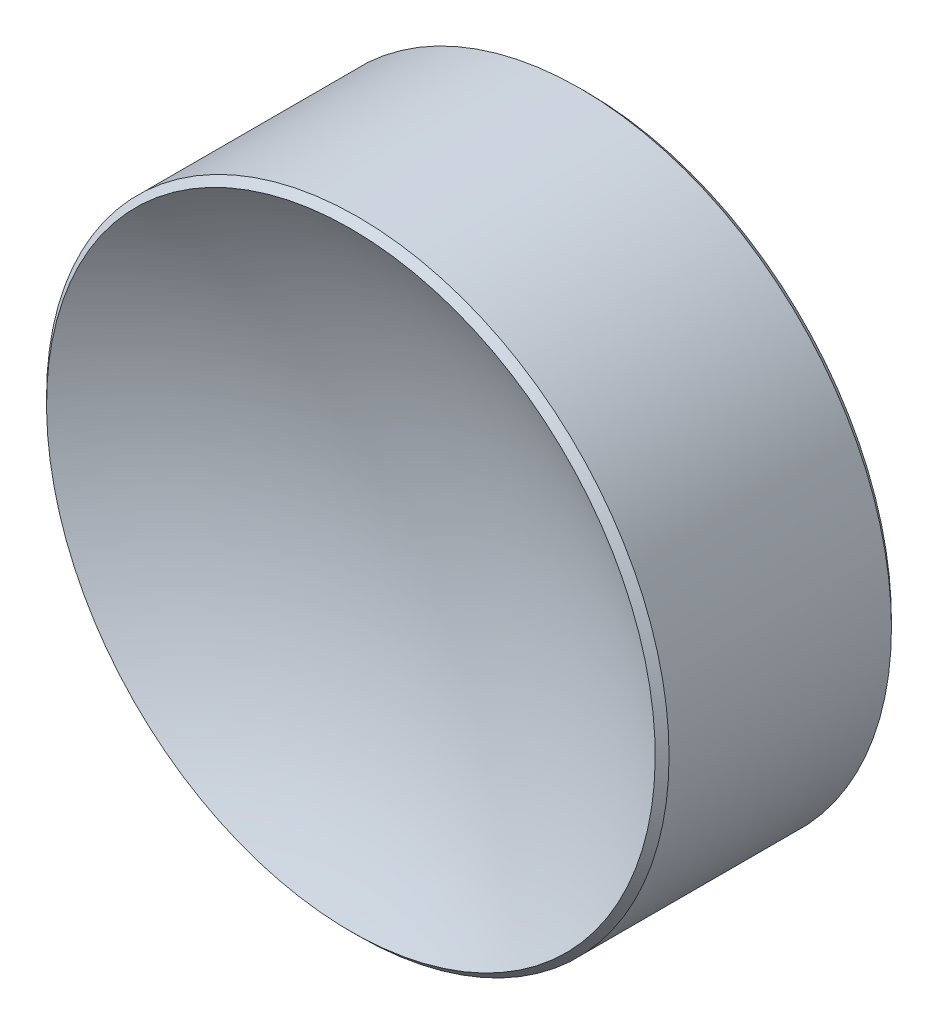
ISO-10303-21;
HEADER;
FILE_DESCRIPTION(('STEP AP214'),'2;1');
FILE_NAME('part.step','',(''),(''),'','','');
FILE_SCHEMA(('AUTOMOTIVE_DESIGN { 1 0 10303 214 1 1 1 1 }'));
ENDSEC;
DATA;
#1=APPLICATION_CONTEXT('core data for automotive mechanical design processes');
#2=APPLICATION_PROTOCOL_DEFINITION('international standard','automotive_design',2000,#1);
#3=PRODUCT_CONTEXT('',#1,'mechanical');
#4=PRODUCT('Part','Part','',(#3));
#5=PRODUCT_RELATED_PRODUCT_CATEGORY('part','',(#4));
#6=PRODUCT_DEFINITION_FORMATION('','',#4);
#7=PRODUCT_DEFINITION_CONTEXT('part definition',#1,'design');
#8=PRODUCT_DEFINITION('design','',#6,#7);
#9=PRODUCT_DEFINITION_SHAPE('','',#8);
#10=(LENGTH_UNIT() NAMED_UNIT(*) SI_UNIT(.MILLI.,.METRE.));
#11=(NAMED_UNIT(*) PLANE_ANGLE_UNIT() SI_UNIT($,.RADIAN.));
#12=(NAMED_UNIT(*) SI_UNIT($,.STERADIAN.) SOLID_ANGLE_UNIT());
#13=UNCERTAINTY_MEASURE_WITH_UNIT(LENGTH_MEASURE(1.E-05),#10,'distance_accuracy_value','');
#14=(GEOMETRIC_REPRESENTATION_CONTEXT(3) GLOBAL_UNCERTAINTY_ASSIGNED_CONTEXT((#13)) GLOBAL_UNIT_ASSIGNED_CONTEXT((#10,
#11,#12)) REPRESENTATION_CONTEXT('',''));
#15=CARTESIAN_POINT('',(0.,0.,0.));
#16=DIRECTION('',(0.,0.,1.));
#17=DIRECTION('',(1.,0.,0.));
#18=AXIS2_PLACEMENT_3D('',#15,#16,#17);
#19=CARTESIAN_POINT('',(0.,0.,13.));
#20=DIRECTION('',(0.,0.,-1.));
#21=DIRECTION('',(0.,1.,0.));
#22=AXIS2_PLACEMENT_3D('',#19,#20,#21);
#23=SPHERICAL_SURFACE('',#22,11.5);
#24=CARTESIAN_POINT('',(0.,0.,3.31994053612201));
#25=DIRECTION('',(0.,0.,-1.));
#26=DIRECTION('',(0.,1.,0.));
#27=AXIS2_PLACEMENT_3D('',#24,#25,#26);
#28=CIRCLE('',#27,6.20857864376269);
#29=CARTESIAN_POINT('',(0.,6.20857864376269,3.31994053612201));
#30=VERTEX_POINT('',#29);
#31=EDGE_CURVE('E9',#30,#30,#28,.T.);
#32=ORIENTED_EDGE('',*,*,#31,.F.);
#33=EDGE_LOOP('',(#32));
#34=FACE_BOUND('',#33,.T.);
#35=ADVANCED_FACE('F13',(#34),#23,.F.);
#36=CARTESIAN_POINT('',(0.,0.,3.1785191798847));
#37=DIRECTION('',(0.,0.,-1.));
#38=DIRECTION('',(0.,1.,0.));
#39=AXIS2_PLACEMENT_3D('',#36,#37,#38);
#40=CONICAL_SURFACE('',#39,6.35,0.785398163397436);
#41=ORIENTED_EDGE('',*,*,#31,.T.);
#42=EDGE_LOOP('',(#41));
#43=FACE_BOUND('',#42,.T.);
#44=CARTESIAN_POINT('',(0.,0.,3.1785191798847));
#45=DIRECTION('',(0.,0.,-1.));
#46=DIRECTION('',(0.,1.,0.));
#47=AXIS2_PLACEMENT_3D('',#44,#45,#46);
#48=CIRCLE('',#47,6.35);
#49=CARTESIAN_POINT('',(0.,6.35,3.1785191798847));
#50=VERTEX_POINT('',#49);
#51=EDGE_CURVE('E19',#50,#50,#48,.T.);
#52=ORIENTED_EDGE('',*,*,#51,.F.);
#53=EDGE_LOOP('',(#52));
#54=FACE_BOUND('',#53,.T.);
#55=ADVANCED_FACE('F47',(#43,#54),#40,.T.);
#56=CARTESIAN_POINT('',(0.,0.,-1.5));
#57=DIRECTION('',(0.,0.,-1.));
#58=DIRECTION('',(0.,1.,0.));
#59=AXIS2_PLACEMENT_3D('',#56,#57,#58);
#60=CYLINDRICAL_SURFACE('',#59,6.35);
#61=ORIENTED_EDGE('',*,*,#51,.T.);
#62=EDGE_LOOP('',(#61));
#63=FACE_BOUND('',#62,.T.);
#64=CARTESIAN_POINT('',(0.,0.,-1.35857864376269));
#65=DIRECTION('',(0.,0.,-1.));
#66=DIRECTION('',(0.,1.,0.));
#67=AXIS2_PLACEMENT_3D('',#64,#65,#66);
#68=CIRCLE('',#67,6.35);
#69=CARTESIAN_POINT('',(0.,6.35,-1.35857864376269));
#70=VERTEX_POINT('',#69);
#71=EDGE_CURVE('E23',#70,#70,#68,.T.);
#72=ORIENTED_EDGE('',*,*,#71,.F.);
#73=EDGE_LOOP('',(#72));
#74=FACE_BOUND('',#73,.T.);
#75=ADVANCED_FACE('F37',(#63,#74),#60,.T.);
#76=CARTESIAN_POINT('',(0.,0.,-1.5));
#77=DIRECTION('',(0.,0.,1.));
#78=DIRECTION('',(0.,-1.,0.));
#79=AXIS2_PLACEMENT_3D('',#76,#77,#78);
#80=CONICAL_SURFACE('',#79,6.20857864376269,0.785398163397448);
#81=ORIENTED_EDGE('',*,*,#71,.T.);
#82=EDGE_LOOP('',(#81));
#83=FACE_BOUND('',#82,.T.);
#84=CARTESIAN_POINT('',(0.,0.,-1.5));
#85=DIRECTION('',(0.,0.,-1.));
#86=DIRECTION('',(0.,1.,0.));
#87=AXIS2_PLACEMENT_3D('',#84,#85,#86);
#88=CIRCLE('',#87,6.20857864376269);
#89=CARTESIAN_POINT('',(0.,6.20857864376269,-1.5));
#90=VERTEX_POINT('',#89);
#91=EDGE_CURVE('E27',#90,#90,#88,.T.);
#92=ORIENTED_EDGE('',*,*,#91,.F.);
#93=EDGE_LOOP('',(#92));
#94=FACE_BOUND('',#93,.T.);
#95=ADVANCED_FACE('F35',(#83,#94),#80,.T.);
#96=CARTESIAN_POINT('',(0.,0.,-1.5));
#97=DIRECTION('',(0.,0.,-1.));
#98=DIRECTION('',(0.,1.,0.));
#99=AXIS2_PLACEMENT_3D('',#96,#97,#98);
#100=PLANE('',#99);
#101=ORIENTED_EDGE('',*,*,#91,.T.);
#102=EDGE_LOOP('',(#101));
#103=FACE_BOUND('',#102,.T.);
#104=ADVANCED_FACE('F33',(#103),#100,.T.);
#105=CLOSED_SHELL('',(#35,#55,#75,#95,#104));
#106=MANIFOLD_SOLID_BREP('B1',#105);
#107=ADVANCED_BREP_SHAPE_REPRESENTATION('',(#18,#106),#14);
#108=SHAPE_DEFINITION_REPRESENTATION(#9,#107);
ENDSEC;
END-ISO-10303-21;
